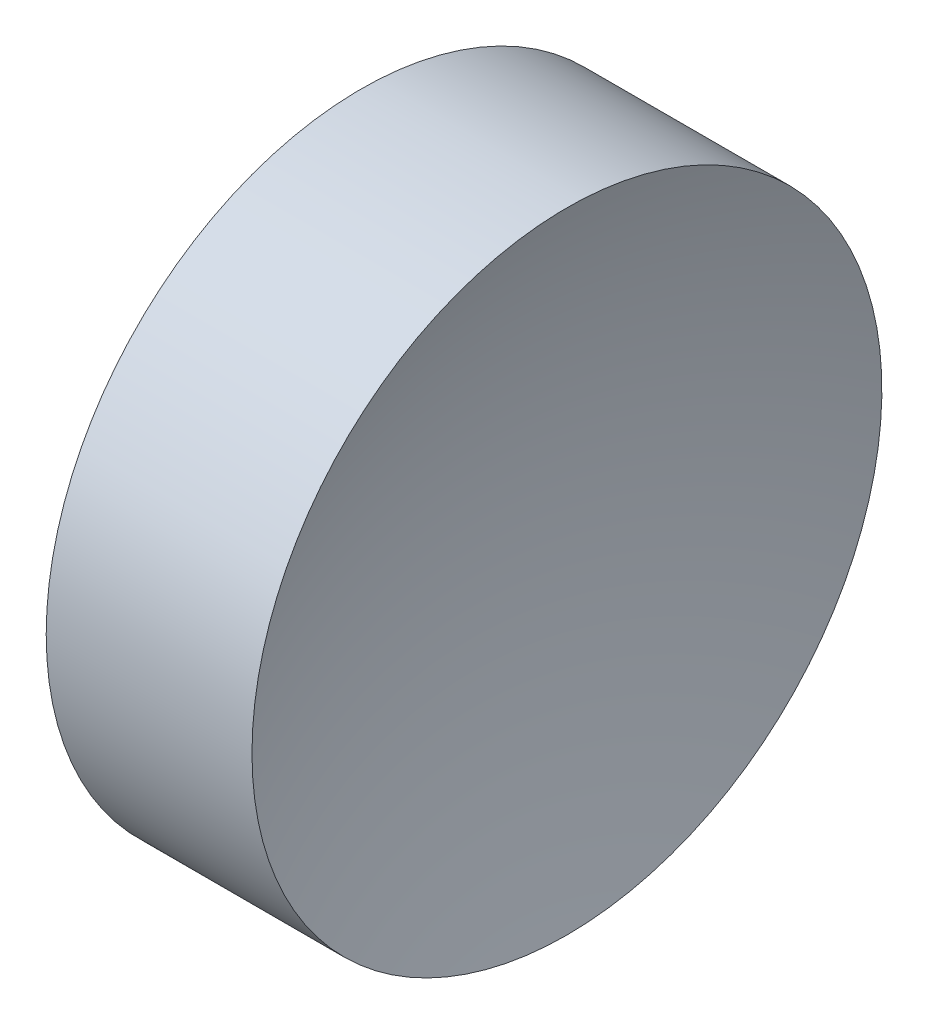
ISO-10303-21;
HEADER;
FILE_DESCRIPTION(('STEP AP214'),'2;1');
FILE_NAME('part.step','',(''),(''),'','','');
FILE_SCHEMA(('AUTOMOTIVE_DESIGN { 1 0 10303 214 1 1 1 1 }'));
ENDSEC;
DATA;
#1=APPLICATION_CONTEXT('core data for automotive mechanical design processes');
#2=APPLICATION_PROTOCOL_DEFINITION('international standard','automotive_design',2000,#1);
#3=PRODUCT_CONTEXT('',#1,'mechanical');
#4=PRODUCT('Part','Part','',(#3));
#5=PRODUCT_RELATED_PRODUCT_CATEGORY('part','',(#4));
#6=PRODUCT_DEFINITION_FORMATION('','',#4);
#7=PRODUCT_DEFINITION_CONTEXT('part definition',#1,'design');
#8=PRODUCT_DEFINITION('design','',#6,#7);
#9=PRODUCT_DEFINITION_SHAPE('','',#8);
#10=(LENGTH_UNIT() NAMED_UNIT(*) SI_UNIT(.MILLI.,.METRE.));
#11=(NAMED_UNIT(*) PLANE_ANGLE_UNIT() SI_UNIT($,.RADIAN.));
#12=(NAMED_UNIT(*) SI_UNIT($,.STERADIAN.) SOLID_ANGLE_UNIT());
#13=UNCERTAINTY_MEASURE_WITH_UNIT(LENGTH_MEASURE(1.E-05),#10,'distance_accuracy_value','');
#14=(GEOMETRIC_REPRESENTATION_CONTEXT(3) GLOBAL_UNCERTAINTY_ASSIGNED_CONTEXT((#13)) GLOBAL_UNIT_ASSIGNED_CONTEXT((#10,
#11,#12)) REPRESENTATION_CONTEXT('',''));
#15=CARTESIAN_POINT('',(0.,0.,0.));
#16=DIRECTION('',(0.,0.,1.));
#17=DIRECTION('',(1.,0.,0.));
#18=AXIS2_PLACEMENT_3D('',#15,#16,#17);
#19=CARTESIAN_POINT('',(32.8708755012594,13.031126091403,0.));
#20=DIRECTION('',(-1.,0.,0.));
#21=DIRECTION('',(0.,-1.,0.));
#22=AXIS2_PLACEMENT_3D('',#19,#20,#21);
#23=SPHERICAL_SURFACE('',#22,9.17000000000001);
#24=CARTESIAN_POINT('',(24.2588838616907,13.031126091403,0.));
#25=DIRECTION('',(-1.,0.,0.));
#26=DIRECTION('',(0.,0.,1.));
#27=AXIS2_PLACEMENT_3D('',#24,#25,#26);
#28=CIRCLE('',#27,3.15);
#29=CARTESIAN_POINT('',(24.2588838616907,13.031126091403,3.15));
#30=VERTEX_POINT('',#29);
#31=EDGE_CURVE('E10',#30,#30,#28,.T.);
#32=ORIENTED_EDGE('',*,*,#31,.F.);
#33=EDGE_LOOP('',(#32));
#34=FACE_BOUND('',#33,.T.);
#35=ADVANCED_FACE('F35',(#34),#23,.F.);
#36=CARTESIAN_POINT('',(21.1564719224443,13.031126091403,0.));
#37=DIRECTION('',(-1.,0.,0.));
#38=DIRECTION('',(0.,0.,1.));
#39=AXIS2_PLACEMENT_3D('',#36,#37,#38);
#40=CYLINDRICAL_SURFACE('',#39,3.15);
#41=CARTESIAN_POINT('',(22.2008754892866,13.031126091403,0.));
#42=DIRECTION('',(-1.,0.,0.));
#43=DIRECTION('',(0.,0.,1.));
#44=AXIS2_PLACEMENT_3D('',#41,#42,#43);
#45=CIRCLE('',#44,3.15);
#46=CARTESIAN_POINT('',(22.2008754892866,13.031126091403,3.15));
#47=VERTEX_POINT('',#46);
#48=EDGE_CURVE('E41',#47,#47,#45,.T.);
#49=ORIENTED_EDGE('',*,*,#48,.F.);
#50=EDGE_LOOP('',(#49));
#51=FACE_BOUND('',#50,.T.);
#52=ORIENTED_EDGE('',*,*,#31,.T.);
#53=EDGE_LOOP('',(#52));
#54=FACE_BOUND('',#53,.T.);
#55=ADVANCED_FACE('F49',(#51,#54),#40,.T.);
#56=CARTESIAN_POINT('',(22.2008754892866,13.031126091403,0.));
#57=DIRECTION('',(1.,0.,0.));
#58=DIRECTION('',(0.,0.,-1.));
#59=AXIS2_PLACEMENT_3D('',#56,#57,#58);
#60=PLANE('',#59);
#61=ORIENTED_EDGE('',*,*,#48,.T.);
#62=EDGE_LOOP('',(#61));
#63=FACE_BOUND('',#62,.T.);
#64=ADVANCED_FACE('F47',(#63),#60,.F.);
#65=CLOSED_SHELL('',(#35,#55,#64));
#66=MANIFOLD_SOLID_BREP('B2',#65);
#67=ADVANCED_BREP_SHAPE_REPRESENTATION('',(#18,#66),#14);
#68=SHAPE_DEFINITION_REPRESENTATION(#9,#67);
ENDSEC;
END-ISO-10303-21;
